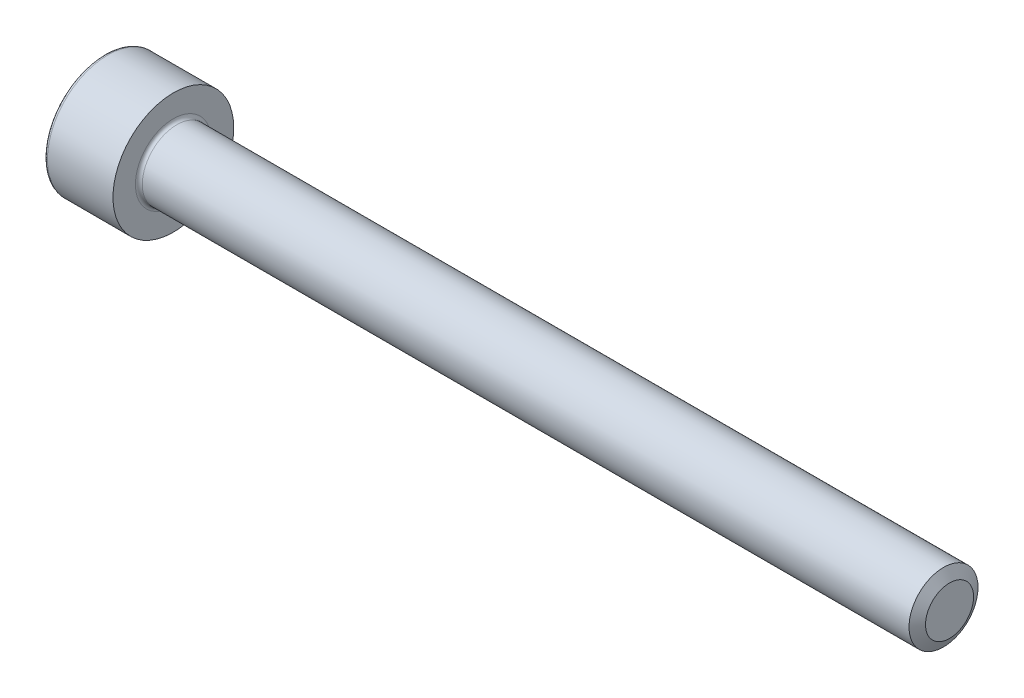
ISO-10303-21;
HEADER;
FILE_DESCRIPTION(('STEP AP214'),'2;1');
FILE_NAME('part.step','',(''),(''),'','','');
FILE_SCHEMA(('AUTOMOTIVE_DESIGN { 1 0 10303 214 1 1 1 1 }'));
ENDSEC;
DATA;
#1=APPLICATION_CONTEXT('core data for automotive mechanical design processes');
#2=APPLICATION_PROTOCOL_DEFINITION('international standard','automotive_design',2000,#1);
#3=PRODUCT_CONTEXT('',#1,'mechanical');
#4=PRODUCT('Part','Part','',(#3));
#5=PRODUCT_RELATED_PRODUCT_CATEGORY('part','',(#4));
#6=PRODUCT_DEFINITION_FORMATION('','',#4);
#7=PRODUCT_DEFINITION_CONTEXT('part definition',#1,'design');
#8=PRODUCT_DEFINITION('design','',#6,#7);
#9=PRODUCT_DEFINITION_SHAPE('','',#8);
#10=(LENGTH_UNIT() NAMED_UNIT(*) SI_UNIT(.MILLI.,.METRE.));
#11=(NAMED_UNIT(*) PLANE_ANGLE_UNIT() SI_UNIT($,.RADIAN.));
#12=(NAMED_UNIT(*) SI_UNIT($,.STERADIAN.) SOLID_ANGLE_UNIT());
#13=UNCERTAINTY_MEASURE_WITH_UNIT(LENGTH_MEASURE(1.E-05),#10,'distance_accuracy_value','');
#14=(GEOMETRIC_REPRESENTATION_CONTEXT(3) GLOBAL_UNCERTAINTY_ASSIGNED_CONTEXT((#13)) GLOBAL_UNIT_ASSIGNED_CONTEXT((#10,
#11,#12)) REPRESENTATION_CONTEXT('',''));
#15=CARTESIAN_POINT('',(0.,0.,0.));
#16=DIRECTION('',(0.,0.,1.));
#17=DIRECTION('',(1.,0.,0.));
#18=AXIS2_PLACEMENT_3D('',#15,#16,#17);
#19=CARTESIAN_POINT('',(0.,0.,0.));
#20=DIRECTION('',(1.,0.,0.));
#21=DIRECTION('',(0.,0.,-1.));
#22=AXIS2_PLACEMENT_3D('',#19,#20,#21);
#23=CYLINDRICAL_SURFACE('',#22,3.5);
#24=CARTESIAN_POINT('',(0.2,0.,0.));
#25=DIRECTION('',(-1.,0.,0.));
#26=DIRECTION('',(0.,0.,1.));
#27=AXIS2_PLACEMENT_3D('',#24,#25,#26);
#28=CIRCLE('',#27,3.5);
#29=CARTESIAN_POINT('',(0.2,0.,3.5));
#30=VERTEX_POINT('',#29);
#31=EDGE_CURVE('E45',#30,#30,#28,.F.);
#32=ORIENTED_EDGE('',*,*,#31,.T.);
#33=EDGE_LOOP('',(#32));
#34=FACE_BOUND('',#33,.T.);
#35=CARTESIAN_POINT('',(4.,0.,0.));
#36=DIRECTION('',(1.,0.,0.));
#37=DIRECTION('',(0.,0.,-1.));
#38=AXIS2_PLACEMENT_3D('',#35,#36,#37);
#39=CIRCLE('',#38,3.5);
#40=CARTESIAN_POINT('',(4.,0.,-3.5));
#41=VERTEX_POINT('',#40);
#42=EDGE_CURVE('E139',#41,#41,#39,.T.);
#43=ORIENTED_EDGE('',*,*,#42,.F.);
#44=EDGE_LOOP('',(#43));
#45=FACE_BOUND('',#44,.T.);
#46=ADVANCED_FACE('F37',(#34,#45),#23,.T.);
#47=CARTESIAN_POINT('',(0.,3.5,0.));
#48=DIRECTION('',(-1.,0.,0.));
#49=DIRECTION('',(0.,0.,1.));
#50=AXIS2_PLACEMENT_3D('',#47,#48,#49);
#51=PLANE('',#50);
#52=CARTESIAN_POINT('',(0.,0.,0.));
#53=DIRECTION('',(-1.,0.,0.));
#54=DIRECTION('',(0.,0.,1.));
#55=AXIS2_PLACEMENT_3D('',#52,#53,#54);
#56=CIRCLE('',#55,3.3);
#57=CARTESIAN_POINT('',(0.,0.,3.3));
#58=VERTEX_POINT('',#57);
#59=EDGE_CURVE('E11',#58,#58,#56,.T.);
#60=ORIENTED_EDGE('',*,*,#59,.T.);
#61=EDGE_LOOP('',(#60));
#62=FACE_BOUND('',#61,.T.);
#63=DIRECTION('',(0.,0.5,-0.866025403784439));
#64=VECTOR('',#63,1.);
#65=CARTESIAN_POINT('',(0.,0.860000000000001,1.48956369450923));
#66=LINE('',#65,#64);
#67=CARTESIAN_POINT('',(0.,0.860000000000001,1.48956369450923));
#68=VERTEX_POINT('',#67);
#69=CARTESIAN_POINT('',(0.,1.72,0.));
#70=VERTEX_POINT('',#69);
#71=EDGE_CURVE('E52',#68,#70,#66,.T.);
#72=ORIENTED_EDGE('',*,*,#71,.F.);
#73=DIRECTION('',(0.,1.,0.));
#74=VECTOR('',#73,1.);
#75=CARTESIAN_POINT('',(0.,-0.86,1.48956369450923));
#76=LINE('',#75,#74);
#77=CARTESIAN_POINT('',(0.,-0.86,1.48956369450923));
#78=VERTEX_POINT('',#77);
#79=EDGE_CURVE('E135',#78,#68,#76,.T.);
#80=ORIENTED_EDGE('',*,*,#79,.F.);
#81=DIRECTION('',(0.,0.5,0.866025403784439));
#82=VECTOR('',#81,1.);
#83=CARTESIAN_POINT('',(0.,-1.72,0.));
#84=LINE('',#83,#82);
#85=CARTESIAN_POINT('',(0.,-1.72,0.));
#86=VERTEX_POINT('',#85);
#87=EDGE_CURVE('E133',#86,#78,#84,.T.);
#88=ORIENTED_EDGE('',*,*,#87,.F.);
#89=DIRECTION('',(0.,-0.5,0.866025403784438));
#90=VECTOR('',#89,1.);
#91=CARTESIAN_POINT('',(0.,-0.86,-1.48956369450923));
#92=LINE('',#91,#90);
#93=CARTESIAN_POINT('',(0.,-0.86,-1.48956369450923));
#94=VERTEX_POINT('',#93);
#95=EDGE_CURVE('E100',#94,#86,#92,.T.);
#96=ORIENTED_EDGE('',*,*,#95,.F.);
#97=DIRECTION('',(0.,-1.,0.));
#98=VECTOR('',#97,1.);
#99=CARTESIAN_POINT('',(0.,0.86,-1.48956369450923));
#100=LINE('',#99,#98);
#101=CARTESIAN_POINT('',(0.,0.86,-1.48956369450923));
#102=VERTEX_POINT('',#101);
#103=EDGE_CURVE('E129',#102,#94,#100,.T.);
#104=ORIENTED_EDGE('',*,*,#103,.F.);
#105=DIRECTION('',(0.,-0.5,-0.866025403784439));
#106=VECTOR('',#105,1.);
#107=CARTESIAN_POINT('',(0.,1.72,0.));
#108=LINE('',#107,#106);
#109=EDGE_CURVE('E126',#70,#102,#108,.T.);
#110=ORIENTED_EDGE('',*,*,#109,.F.);
#111=EDGE_LOOP('',(#72,#80,#88,#96,#104,#110));
#112=FACE_BOUND('',#111,.T.);
#113=ADVANCED_FACE('F173',(#62,#112),#51,.T.);
#114=CARTESIAN_POINT('',(4.,0.,0.));
#115=DIRECTION('',(1.,0.,0.));
#116=DIRECTION('',(0.,0.,-1.));
#117=AXIS2_PLACEMENT_3D('',#114,#115,#116);
#118=PLANE('',#117);
#119=CARTESIAN_POINT('',(4.,0.,0.));
#120=DIRECTION('',(1.,0.,0.));
#121=DIRECTION('',(0.,0.,-1.));
#122=AXIS2_PLACEMENT_3D('',#119,#120,#121);
#123=CIRCLE('',#122,2.2);
#124=CARTESIAN_POINT('',(4.,0.,-2.2));
#125=VERTEX_POINT('',#124);
#126=EDGE_CURVE('E156',#125,#125,#123,.F.);
#127=ORIENTED_EDGE('',*,*,#126,.T.);
#128=EDGE_LOOP('',(#127));
#129=FACE_BOUND('',#128,.T.);
#130=ORIENTED_EDGE('',*,*,#42,.T.);
#131=EDGE_LOOP('',(#130));
#132=FACE_BOUND('',#131,.T.);
#133=ADVANCED_FACE('F178',(#129,#132),#118,.T.);
#134=CARTESIAN_POINT('',(49.,0.,0.));
#135=DIRECTION('',(-1.,0.,0.));
#136=DIRECTION('',(0.,0.,1.));
#137=AXIS2_PLACEMENT_3D('',#134,#135,#136);
#138=CYLINDRICAL_SURFACE('',#137,2.);
#139=CARTESIAN_POINT('',(4.2,0.,0.));
#140=DIRECTION('',(1.,0.,0.));
#141=DIRECTION('',(0.,0.,-1.));
#142=AXIS2_PLACEMENT_3D('',#139,#140,#141);
#143=CIRCLE('',#142,2.);
#144=CARTESIAN_POINT('',(4.2,0.,-2.));
#145=VERTEX_POINT('',#144);
#146=EDGE_CURVE('E153',#145,#145,#143,.T.);
#147=ORIENTED_EDGE('',*,*,#146,.T.);
#148=EDGE_LOOP('',(#147));
#149=FACE_BOUND('',#148,.T.);
#150=CARTESIAN_POINT('',(48.6500000000051,0.,0.));
#151=DIRECTION('',(1.,0.,0.));
#152=DIRECTION('',(0.,0.,-1.));
#153=AXIS2_PLACEMENT_3D('',#150,#151,#152);
#154=CIRCLE('',#153,2.);
#155=CARTESIAN_POINT('',(48.6500000000051,0.,-2.));
#156=VERTEX_POINT('',#155);
#157=EDGE_CURVE('E150',#156,#156,#154,.F.);
#158=ORIENTED_EDGE('',*,*,#157,.T.);
#159=EDGE_LOOP('',(#158));
#160=FACE_BOUND('',#159,.T.);
#161=ADVANCED_FACE('F200',(#149,#160),#138,.T.);
#162=CARTESIAN_POINT('',(49.,0.,0.));
#163=DIRECTION('',(1.,0.,0.));
#164=DIRECTION('',(0.,0.,-1.));
#165=AXIS2_PLACEMENT_3D('',#162,#163,#164);
#166=PLANE('',#165);
#167=CARTESIAN_POINT('',(49.,0.,0.));
#168=DIRECTION('',(1.,0.,0.));
#169=DIRECTION('',(0.,0.,-1.));
#170=AXIS2_PLACEMENT_3D('',#167,#168,#169);
#171=CIRCLE('',#170,1.39380000004539);
#172=CARTESIAN_POINT('',(49.,0.,-1.39380000004539));
#173=VERTEX_POINT('',#172);
#174=EDGE_CURVE('E147',#173,#173,#171,.T.);
#175=ORIENTED_EDGE('',*,*,#174,.T.);
#176=EDGE_LOOP('',(#175));
#177=FACE_BOUND('',#176,.T.);
#178=ADVANCED_FACE('F197',(#177),#166,.T.);
#179=CARTESIAN_POINT('',(2.,0.860000000000001,1.48956369450923));
#180=DIRECTION('',(0.,0.866025403784439,0.5));
#181=DIRECTION('',(0.,-0.5,0.866025403784439));
#182=AXIS2_PLACEMENT_3D('',#179,#180,#181);
#183=PLANE('',#182);
#184=ORIENTED_EDGE('',*,*,#71,.T.);
#185=DIRECTION('',(-1.,0.,0.));
#186=VECTOR('',#185,1.);
#187=CARTESIAN_POINT('',(2.,1.72,0.));
#188=LINE('',#187,#186);
#189=CARTESIAN_POINT('',(2.,1.72,0.));
#190=VERTEX_POINT('',#189);
#191=EDGE_CURVE('E82',#190,#70,#188,.T.);
#192=ORIENTED_EDGE('',*,*,#191,.F.);
#193=DIRECTION('',(0.,0.5,-0.866025403784439));
#194=VECTOR('',#193,1.);
#195=CARTESIAN_POINT('',(2.,0.860000000000001,1.48956369450923));
#196=LINE('',#195,#194);
#197=CARTESIAN_POINT('',(2.,0.860000000000001,1.48956369450923));
#198=VERTEX_POINT('',#197);
#199=EDGE_CURVE('E137',#198,#190,#196,.T.);
#200=ORIENTED_EDGE('',*,*,#199,.F.);
#201=DIRECTION('',(-1.,0.,0.));
#202=VECTOR('',#201,1.);
#203=CARTESIAN_POINT('',(2.,0.860000000000001,1.48956369450923));
#204=LINE('',#203,#202);
#205=EDGE_CURVE('E60',#198,#68,#204,.T.);
#206=ORIENTED_EDGE('',*,*,#205,.T.);
#207=EDGE_LOOP('',(#184,#192,#200,#206));
#208=FACE_BOUND('',#207,.T.);
#209=ADVANCED_FACE('F199',(#208),#183,.F.);
#210=CARTESIAN_POINT('',(2.,-0.86,1.48956369450923));
#211=DIRECTION('',(0.,0.,1.));
#212=DIRECTION('',(0.,-1.,0.));
#213=AXIS2_PLACEMENT_3D('',#210,#211,#212);
#214=PLANE('',#213);
#215=ORIENTED_EDGE('',*,*,#79,.T.);
#216=ORIENTED_EDGE('',*,*,#205,.F.);
#217=DIRECTION('',(0.,1.,0.));
#218=VECTOR('',#217,1.);
#219=CARTESIAN_POINT('',(2.,-0.86,1.48956369450923));
#220=LINE('',#219,#218);
#221=CARTESIAN_POINT('',(2.,-0.86,1.48956369450923));
#222=VERTEX_POINT('',#221);
#223=EDGE_CURVE('E112',#222,#198,#220,.T.);
#224=ORIENTED_EDGE('',*,*,#223,.F.);
#225=DIRECTION('',(-1.,0.,0.));
#226=VECTOR('',#225,1.);
#227=CARTESIAN_POINT('',(2.,-0.86,1.48956369450923));
#228=LINE('',#227,#226);
#229=EDGE_CURVE('E104',#222,#78,#228,.T.);
#230=ORIENTED_EDGE('',*,*,#229,.T.);
#231=EDGE_LOOP('',(#215,#216,#224,#230));
#232=FACE_BOUND('',#231,.T.);
#233=ADVANCED_FACE('F206',(#232),#214,.F.);
#234=CARTESIAN_POINT('',(2.,-1.72,0.));
#235=DIRECTION('',(0.,-0.866025403784439,0.5));
#236=DIRECTION('',(0.,-0.5,-0.866025403784439));
#237=AXIS2_PLACEMENT_3D('',#234,#235,#236);
#238=PLANE('',#237);
#239=ORIENTED_EDGE('',*,*,#87,.T.);
#240=ORIENTED_EDGE('',*,*,#229,.F.);
#241=DIRECTION('',(0.,0.5,0.866025403784439));
#242=VECTOR('',#241,1.);
#243=CARTESIAN_POINT('',(2.,-1.72,0.));
#244=LINE('',#243,#242);
#245=CARTESIAN_POINT('',(2.,-1.72,0.));
#246=VERTEX_POINT('',#245);
#247=EDGE_CURVE('E108',#246,#222,#244,.T.);
#248=ORIENTED_EDGE('',*,*,#247,.F.);
#249=DIRECTION('',(-1.,0.,0.));
#250=VECTOR('',#249,1.);
#251=CARTESIAN_POINT('',(2.,-1.72,0.));
#252=LINE('',#251,#250);
#253=EDGE_CURVE('E93',#246,#86,#252,.T.);
#254=ORIENTED_EDGE('',*,*,#253,.T.);
#255=EDGE_LOOP('',(#239,#240,#248,#254));
#256=FACE_BOUND('',#255,.T.);
#257=ADVANCED_FACE('F109',(#256),#238,.F.);
#258=CARTESIAN_POINT('',(2.,-0.86,-1.48956369450923));
#259=DIRECTION('',(0.,-0.866025403784439,-0.5));
#260=DIRECTION('',(0.,0.5,-0.866025403784438));
#261=AXIS2_PLACEMENT_3D('',#258,#259,#260);
#262=PLANE('',#261);
#263=ORIENTED_EDGE('',*,*,#95,.T.);
#264=ORIENTED_EDGE('',*,*,#253,.F.);
#265=DIRECTION('',(0.,-0.5,0.866025403784438));
#266=VECTOR('',#265,1.);
#267=CARTESIAN_POINT('',(2.,-0.86,-1.48956369450923));
#268=LINE('',#267,#266);
#269=CARTESIAN_POINT('',(2.,-0.86,-1.48956369450923));
#270=VERTEX_POINT('',#269);
#271=EDGE_CURVE('E97',#270,#246,#268,.T.);
#272=ORIENTED_EDGE('',*,*,#271,.F.);
#273=DIRECTION('',(-1.,0.,0.));
#274=VECTOR('',#273,1.);
#275=CARTESIAN_POINT('',(2.,-0.86,-1.48956369450923));
#276=LINE('',#275,#274);
#277=EDGE_CURVE('E105',#270,#94,#276,.T.);
#278=ORIENTED_EDGE('',*,*,#277,.T.);
#279=EDGE_LOOP('',(#263,#264,#272,#278));
#280=FACE_BOUND('',#279,.T.);
#281=ADVANCED_FACE('F95',(#280),#262,.F.);
#282=CARTESIAN_POINT('',(2.,0.86,-1.48956369450923));
#283=DIRECTION('',(0.,0.,-1.));
#284=DIRECTION('',(0.,1.,0.));
#285=AXIS2_PLACEMENT_3D('',#282,#283,#284);
#286=PLANE('',#285);
#287=ORIENTED_EDGE('',*,*,#103,.T.);
#288=ORIENTED_EDGE('',*,*,#277,.F.);
#289=DIRECTION('',(0.,-1.,0.));
#290=VECTOR('',#289,1.);
#291=CARTESIAN_POINT('',(2.,0.86,-1.48956369450923));
#292=LINE('',#291,#290);
#293=CARTESIAN_POINT('',(2.,0.86,-1.48956369450923));
#294=VERTEX_POINT('',#293);
#295=EDGE_CURVE('E118',#294,#270,#292,.T.);
#296=ORIENTED_EDGE('',*,*,#295,.F.);
#297=DIRECTION('',(-1.,0.,0.));
#298=VECTOR('',#297,1.);
#299=CARTESIAN_POINT('',(2.,0.86,-1.48956369450923));
#300=LINE('',#299,#298);
#301=EDGE_CURVE('E142',#294,#102,#300,.T.);
#302=ORIENTED_EDGE('',*,*,#301,.T.);
#303=EDGE_LOOP('',(#287,#288,#296,#302));
#304=FACE_BOUND('',#303,.T.);
#305=ADVANCED_FACE('F257',(#304),#286,.F.);
#306=CARTESIAN_POINT('',(2.,1.72,0.));
#307=DIRECTION('',(0.,0.866025403784439,-0.5));
#308=DIRECTION('',(0.,0.5,0.866025403784439));
#309=AXIS2_PLACEMENT_3D('',#306,#307,#308);
#310=PLANE('',#309);
#311=ORIENTED_EDGE('',*,*,#109,.T.);
#312=ORIENTED_EDGE('',*,*,#301,.F.);
#313=DIRECTION('',(0.,-0.5,-0.866025403784439));
#314=VECTOR('',#313,1.);
#315=CARTESIAN_POINT('',(2.,1.72,0.));
#316=LINE('',#315,#314);
#317=EDGE_CURVE('E120',#190,#294,#316,.T.);
#318=ORIENTED_EDGE('',*,*,#317,.F.);
#319=ORIENTED_EDGE('',*,*,#191,.T.);
#320=EDGE_LOOP('',(#311,#312,#318,#319));
#321=FACE_BOUND('',#320,.T.);
#322=ADVANCED_FACE('F191',(#321),#310,.F.);
#323=CARTESIAN_POINT('',(2.,0.,0.));
#324=DIRECTION('',(-1.,0.,0.));
#325=DIRECTION('',(0.,0.,1.));
#326=AXIS2_PLACEMENT_3D('',#323,#324,#325);
#327=PLANE('',#326);
#328=ORIENTED_EDGE('',*,*,#199,.T.);
#329=ORIENTED_EDGE('',*,*,#317,.T.);
#330=ORIENTED_EDGE('',*,*,#295,.T.);
#331=ORIENTED_EDGE('',*,*,#271,.T.);
#332=ORIENTED_EDGE('',*,*,#247,.T.);
#333=ORIENTED_EDGE('',*,*,#223,.T.);
#334=EDGE_LOOP('',(#328,#329,#330,#331,#332,#333));
#335=FACE_BOUND('',#334,.T.);
#336=ADVANCED_FACE('F115',(#335),#327,.T.);
#337=CARTESIAN_POINT('',(49.,0.,0.));
#338=DIRECTION('',(-1.,0.,0.));
#339=DIRECTION('',(0.,0.,1.));
#340=AXIS2_PLACEMENT_3D('',#337,#338,#339);
#341=CONICAL_SURFACE('',#340,1.39380000004539,1.04718484899878);
#342=ORIENTED_EDGE('',*,*,#157,.F.);
#343=EDGE_LOOP('',(#342));
#344=FACE_BOUND('',#343,.T.);
#345=ORIENTED_EDGE('',*,*,#174,.F.);
#346=EDGE_LOOP('',(#345));
#347=FACE_BOUND('',#346,.T.);
#348=ADVANCED_FACE('F169',(#344,#347),#341,.T.);
#349=CARTESIAN_POINT('',(4.2,0.,0.));
#350=DIRECTION('',(1.,0.,0.));
#351=DIRECTION('',(0.,0.,-1.));
#352=AXIS2_PLACEMENT_3D('',#349,#350,#351);
#353=TOROIDAL_SURFACE('',#352,2.2,0.2);
#354=ORIENTED_EDGE('',*,*,#126,.F.);
#355=EDGE_LOOP('',(#354));
#356=FACE_BOUND('',#355,.T.);
#357=ORIENTED_EDGE('',*,*,#146,.F.);
#358=EDGE_LOOP('',(#357));
#359=FACE_BOUND('',#358,.T.);
#360=ADVANCED_FACE('F164',(#356,#359),#353,.F.);
#361=CARTESIAN_POINT('',(0.2,0.,0.));
#362=DIRECTION('',(-1.,0.,0.));
#363=DIRECTION('',(0.,0.,1.));
#364=AXIS2_PLACEMENT_3D('',#361,#362,#363);
#365=TOROIDAL_SURFACE('',#364,3.3,0.2);
#366=ORIENTED_EDGE('',*,*,#59,.F.);
#367=EDGE_LOOP('',(#366));
#368=FACE_BOUND('',#367,.T.);
#369=ORIENTED_EDGE('',*,*,#31,.F.);
#370=EDGE_LOOP('',(#369));
#371=FACE_BOUND('',#370,.T.);
#372=ADVANCED_FACE('F39',(#368,#371),#365,.T.);
#373=CLOSED_SHELL('',(#46,#113,#133,#161,#178,#209,#233,#257,#281,#305,#322,#336,#348,#360,#372));
#374=MANIFOLD_SOLID_BREP('B2',#373);
#375=ADVANCED_BREP_SHAPE_REPRESENTATION('',(#18,#374),#14);
#376=SHAPE_DEFINITION_REPRESENTATION(#9,#375);
ENDSEC;
END-ISO-10303-21;
